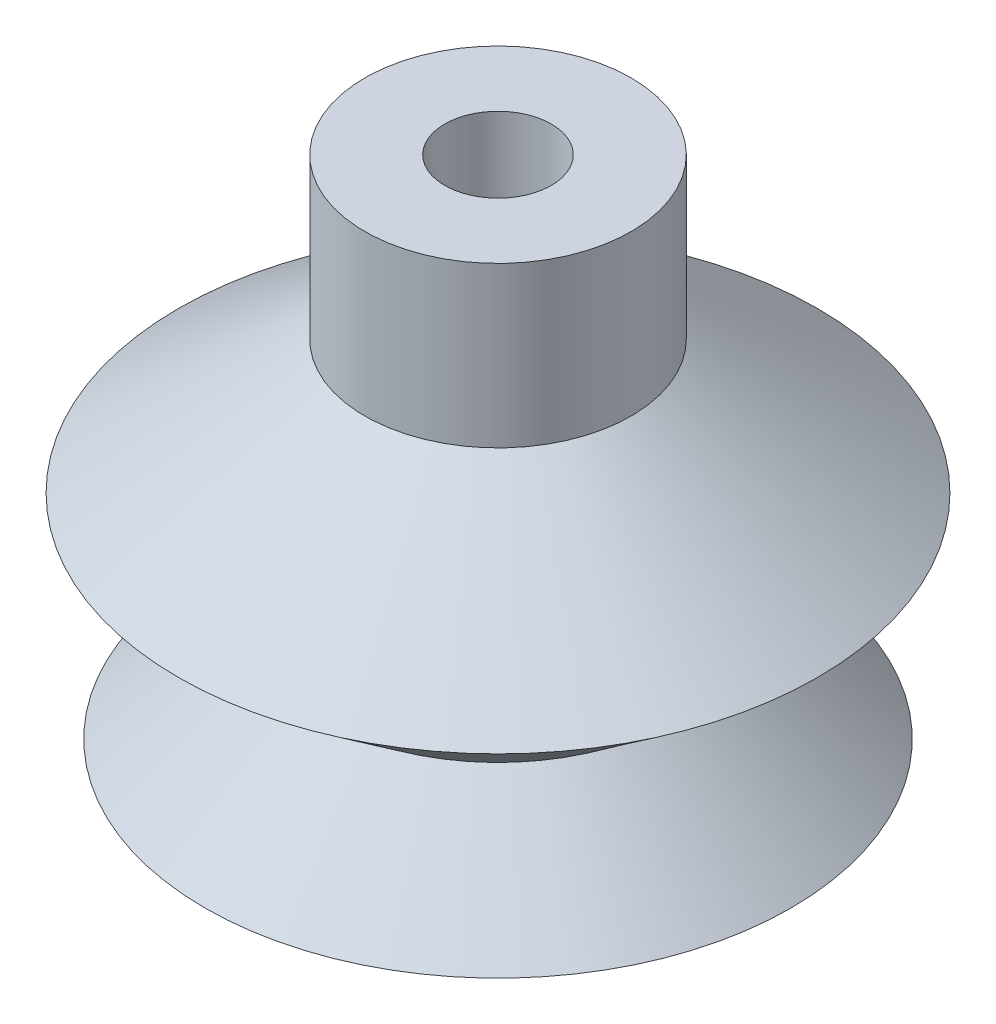
ISO-10303-21;
HEADER;
FILE_DESCRIPTION(('STEP AP214'),'2;1');
FILE_NAME('part.step','',(''),(''),'','','');
FILE_SCHEMA(('AUTOMOTIVE_DESIGN { 1 0 10303 214 1 1 1 1 }'));
ENDSEC;
DATA;
#1=APPLICATION_CONTEXT('core data for automotive mechanical design processes');
#2=APPLICATION_PROTOCOL_DEFINITION('international standard','automotive_design',2000,#1);
#3=PRODUCT_CONTEXT('',#1,'mechanical');
#4=PRODUCT('Part','Part','',(#3));
#5=PRODUCT_RELATED_PRODUCT_CATEGORY('part','',(#4));
#6=PRODUCT_DEFINITION_FORMATION('','',#4);
#7=PRODUCT_DEFINITION_CONTEXT('part definition',#1,'design');
#8=PRODUCT_DEFINITION('design','',#6,#7);
#9=PRODUCT_DEFINITION_SHAPE('','',#8);
#10=(LENGTH_UNIT() NAMED_UNIT(*) SI_UNIT(.MILLI.,.METRE.));
#11=(NAMED_UNIT(*) PLANE_ANGLE_UNIT() SI_UNIT($,.RADIAN.));
#12=(NAMED_UNIT(*) SI_UNIT($,.STERADIAN.) SOLID_ANGLE_UNIT());
#13=UNCERTAINTY_MEASURE_WITH_UNIT(LENGTH_MEASURE(1.E-05),#10,'distance_accuracy_value','');
#14=(GEOMETRIC_REPRESENTATION_CONTEXT(3) GLOBAL_UNCERTAINTY_ASSIGNED_CONTEXT((#13)) GLOBAL_UNIT_ASSIGNED_CONTEXT((#10,
#11,#12)) REPRESENTATION_CONTEXT('',''));
#15=CARTESIAN_POINT('',(0.,0.,0.));
#16=DIRECTION('',(0.,0.,1.));
#17=DIRECTION('',(1.,0.,0.));
#18=AXIS2_PLACEMENT_3D('',#15,#16,#17);
#19=CARTESIAN_POINT('',(5.,19.,0.));
#20=DIRECTION('',(0.,1.,0.));
#21=DIRECTION('',(0.,0.,1.));
#22=AXIS2_PLACEMENT_3D('',#19,#20,#21);
#23=PLANE('',#22);
#24=CARTESIAN_POINT('',(0.,19.,0.));
#25=DIRECTION('',(0.,-1.,0.));
#26=DIRECTION('',(0.,0.,-1.));
#27=AXIS2_PLACEMENT_3D('',#24,#25,#26);
#28=CIRCLE('',#27,2.);
#29=CARTESIAN_POINT('',(0.,19.,-2.));
#30=VERTEX_POINT('',#29);
#31=EDGE_CURVE('E66',#30,#30,#28,.T.);
#32=ORIENTED_EDGE('',*,*,#31,.T.);
#33=EDGE_LOOP('',(#32));
#34=FACE_BOUND('',#33,.T.);
#35=CARTESIAN_POINT('',(0.,19.,0.));
#36=DIRECTION('',(0.,-1.,0.));
#37=DIRECTION('',(0.,0.,-1.));
#38=AXIS2_PLACEMENT_3D('',#35,#36,#37);
#39=CIRCLE('',#38,5.);
#40=CARTESIAN_POINT('',(0.,19.,-5.));
#41=VERTEX_POINT('',#40);
#42=EDGE_CURVE('E10',#41,#41,#39,.T.);
#43=ORIENTED_EDGE('',*,*,#42,.F.);
#44=EDGE_LOOP('',(#43));
#45=FACE_BOUND('',#44,.T.);
#46=ADVANCED_FACE('F29',(#34,#45),#23,.T.);
#47=CARTESIAN_POINT('',(0.,0.,0.));
#48=DIRECTION('',(0.,-1.,0.));
#49=DIRECTION('',(0.,0.,-1.));
#50=AXIS2_PLACEMENT_3D('',#47,#48,#49);
#51=CYLINDRICAL_SURFACE('',#50,5.);
#52=ORIENTED_EDGE('',*,*,#42,.T.);
#53=EDGE_LOOP('',(#52));
#54=FACE_BOUND('',#53,.T.);
#55=CARTESIAN_POINT('',(0.,13.,0.));
#56=DIRECTION('',(0.,-1.,0.));
#57=DIRECTION('',(0.,0.,-1.));
#58=AXIS2_PLACEMENT_3D('',#55,#56,#57);
#59=CIRCLE('',#58,5.);
#60=CARTESIAN_POINT('',(0.,13.,-5.));
#61=VERTEX_POINT('',#60);
#62=EDGE_CURVE('E35',#61,#61,#59,.T.);
#63=ORIENTED_EDGE('',*,*,#62,.F.);
#64=EDGE_LOOP('',(#63));
#65=FACE_BOUND('',#64,.T.);
#66=ADVANCED_FACE('F84',(#54,#65),#51,.T.);
#67=CARTESIAN_POINT('',(0.,8.,0.));
#68=DIRECTION('',(0.,-1.,0.));
#69=DIRECTION('',(0.,0.,-1.));
#70=AXIS2_PLACEMENT_3D('',#67,#68,#69);
#71=CONICAL_SURFACE('',#70,12.,0.950546840812075);
#72=ORIENTED_EDGE('',*,*,#62,.T.);
#73=EDGE_LOOP('',(#72));
#74=FACE_BOUND('',#73,.T.);
#75=CARTESIAN_POINT('',(0.,8.,0.));
#76=DIRECTION('',(0.,-1.,0.));
#77=DIRECTION('',(0.,0.,-1.));
#78=AXIS2_PLACEMENT_3D('',#75,#76,#77);
#79=CIRCLE('',#78,12.);
#80=CARTESIAN_POINT('',(0.,8.,-12.));
#81=VERTEX_POINT('',#80);
#82=EDGE_CURVE('E39',#81,#81,#79,.T.);
#83=ORIENTED_EDGE('',*,*,#82,.F.);
#84=EDGE_LOOP('',(#83));
#85=FACE_BOUND('',#84,.T.);
#86=ADVANCED_FACE('F88',(#74,#85),#71,.T.);
#87=CARTESIAN_POINT('',(0.,4.,0.));
#88=DIRECTION('',(0.,1.,0.));
#89=DIRECTION('',(0.,0.,1.));
#90=AXIS2_PLACEMENT_3D('',#87,#88,#89);
#91=CONICAL_SURFACE('',#90,6.73864357705752,0.920760950293743);
#92=ORIENTED_EDGE('',*,*,#82,.T.);
#93=EDGE_LOOP('',(#92));
#94=FACE_BOUND('',#93,.T.);
#95=CARTESIAN_POINT('',(0.,4.,0.));
#96=DIRECTION('',(0.,-1.,0.));
#97=DIRECTION('',(0.,0.,-1.));
#98=AXIS2_PLACEMENT_3D('',#95,#96,#97);
#99=CIRCLE('',#98,6.73864357705752);
#100=CARTESIAN_POINT('',(0.,4.,-6.73864357705752));
#101=VERTEX_POINT('',#100);
#102=EDGE_CURVE('E43',#101,#101,#99,.T.);
#103=ORIENTED_EDGE('',*,*,#102,.F.);
#104=EDGE_LOOP('',(#103));
#105=FACE_BOUND('',#104,.T.);
#106=ADVANCED_FACE('F92',(#94,#105),#91,.T.);
#107=CARTESIAN_POINT('',(0.,0.,0.));
#108=DIRECTION('',(0.,-1.,0.));
#109=DIRECTION('',(0.,0.,-1.));
#110=AXIS2_PLACEMENT_3D('',#107,#108,#109);
#111=CONICAL_SURFACE('',#110,11.,0.817023633853532);
#112=ORIENTED_EDGE('',*,*,#102,.T.);
#113=EDGE_LOOP('',(#112));
#114=FACE_BOUND('',#113,.T.);
#115=CARTESIAN_POINT('',(0.,0.,0.));
#116=DIRECTION('',(0.,-1.,0.));
#117=DIRECTION('',(0.,0.,-1.));
#118=AXIS2_PLACEMENT_3D('',#115,#116,#117);
#119=CIRCLE('',#118,11.);
#120=CARTESIAN_POINT('',(0.,0.,-11.));
#121=VERTEX_POINT('',#120);
#122=EDGE_CURVE('E48',#121,#121,#119,.T.);
#123=ORIENTED_EDGE('',*,*,#122,.F.);
#124=EDGE_LOOP('',(#123));
#125=FACE_BOUND('',#124,.T.);
#126=ADVANCED_FACE('F98',(#114,#125),#111,.T.);
#127=CARTESIAN_POINT('',(11.,0.,0.));
#128=DIRECTION('',(0.,-1.,0.));
#129=DIRECTION('',(0.,0.,-1.));
#130=AXIS2_PLACEMENT_3D('',#127,#128,#129);
#131=PLANE('',#130);
#132=ORIENTED_EDGE('',*,*,#122,.T.);
#133=EDGE_LOOP('',(#132));
#134=FACE_BOUND('',#133,.T.);
#135=CARTESIAN_POINT('',(0.,0.,0.));
#136=DIRECTION('',(0.,-1.,0.));
#137=DIRECTION('',(0.,0.,-1.));
#138=AXIS2_PLACEMENT_3D('',#135,#136,#137);
#139=CIRCLE('',#138,9.53885407634639);
#140=CARTESIAN_POINT('',(0.,0.,-9.53885407634639));
#141=VERTEX_POINT('',#140);
#142=EDGE_CURVE('E51',#141,#141,#139,.T.);
#143=ORIENTED_EDGE('',*,*,#142,.F.);
#144=EDGE_LOOP('',(#143));
#145=FACE_BOUND('',#144,.T.);
#146=ADVANCED_FACE('F102',(#134,#145),#131,.T.);
#147=CARTESIAN_POINT('',(0.,4.,0.));
#148=DIRECTION('',(0.,-1.,0.));
#149=DIRECTION('',(0.,0.,-1.));
#150=AXIS2_PLACEMENT_3D('',#147,#148,#149);
#151=CONICAL_SURFACE('',#150,5.2774976534039,0.817023633853532);
#152=ORIENTED_EDGE('',*,*,#142,.T.);
#153=EDGE_LOOP('',(#152));
#154=FACE_BOUND('',#153,.T.);
#155=CARTESIAN_POINT('',(0.,4.,0.));
#156=DIRECTION('',(0.,-1.,0.));
#157=DIRECTION('',(0.,0.,-1.));
#158=AXIS2_PLACEMENT_3D('',#155,#156,#157);
#159=CIRCLE('',#158,5.2774976534039);
#160=CARTESIAN_POINT('',(0.,4.,-5.2774976534039));
#161=VERTEX_POINT('',#160);
#162=EDGE_CURVE('E54',#161,#161,#159,.T.);
#163=ORIENTED_EDGE('',*,*,#162,.F.);
#164=EDGE_LOOP('',(#163));
#165=FACE_BOUND('',#164,.T.);
#166=ADVANCED_FACE('F106',(#154,#165),#151,.F.);
#167=CARTESIAN_POINT('',(0.,8.,0.));
#168=DIRECTION('',(0.,1.,0.));
#169=DIRECTION('',(0.,0.,1.));
#170=AXIS2_PLACEMENT_3D('',#167,#168,#169);
#171=CONICAL_SURFACE('',#170,10.,0.868041502476456);
#172=ORIENTED_EDGE('',*,*,#162,.T.);
#173=EDGE_LOOP('',(#172));
#174=FACE_BOUND('',#173,.T.);
#175=CARTESIAN_POINT('',(0.,8.,0.));
#176=DIRECTION('',(0.,-1.,0.));
#177=DIRECTION('',(0.,0.,-1.));
#178=AXIS2_PLACEMENT_3D('',#175,#176,#177);
#179=CIRCLE('',#178,10.);
#180=CARTESIAN_POINT('',(0.,8.,-10.));
#181=VERTEX_POINT('',#180);
#182=EDGE_CURVE('E57',#181,#181,#179,.T.);
#183=ORIENTED_EDGE('',*,*,#182,.F.);
#184=EDGE_LOOP('',(#183));
#185=FACE_BOUND('',#184,.T.);
#186=ADVANCED_FACE('F110',(#174,#185),#171,.F.);
#187=CARTESIAN_POINT('',(0.,10.,0.));
#188=DIRECTION('',(0.,-1.,0.));
#189=DIRECTION('',(0.,0.,-1.));
#190=AXIS2_PLACEMENT_3D('',#187,#188,#189);
#191=CONICAL_SURFACE('',#190,3.68864893535733,1.26391762293674);
#192=ORIENTED_EDGE('',*,*,#182,.T.);
#193=EDGE_LOOP('',(#192));
#194=FACE_BOUND('',#193,.T.);
#195=CARTESIAN_POINT('',(0.,10.,0.));
#196=DIRECTION('',(0.,-1.,0.));
#197=DIRECTION('',(0.,0.,-1.));
#198=AXIS2_PLACEMENT_3D('',#195,#196,#197);
#199=CIRCLE('',#198,3.68864893535733);
#200=CARTESIAN_POINT('',(0.,10.,-3.68864893535733));
#201=VERTEX_POINT('',#200);
#202=EDGE_CURVE('E60',#201,#201,#199,.T.);
#203=ORIENTED_EDGE('',*,*,#202,.F.);
#204=EDGE_LOOP('',(#203));
#205=FACE_BOUND('',#204,.T.);
#206=ADVANCED_FACE('F80',(#194,#205),#191,.F.);
#207=CARTESIAN_POINT('',(2.,10.,0.));
#208=DIRECTION('',(0.,-1.,0.));
#209=DIRECTION('',(0.,0.,-1.));
#210=AXIS2_PLACEMENT_3D('',#207,#208,#209);
#211=PLANE('',#210);
#212=ORIENTED_EDGE('',*,*,#202,.T.);
#213=EDGE_LOOP('',(#212));
#214=FACE_BOUND('',#213,.T.);
#215=CARTESIAN_POINT('',(0.,10.,0.));
#216=DIRECTION('',(0.,-1.,0.));
#217=DIRECTION('',(0.,0.,-1.));
#218=AXIS2_PLACEMENT_3D('',#215,#216,#217);
#219=CIRCLE('',#218,2.);
#220=CARTESIAN_POINT('',(0.,10.,-2.));
#221=VERTEX_POINT('',#220);
#222=EDGE_CURVE('E63',#221,#221,#219,.T.);
#223=ORIENTED_EDGE('',*,*,#222,.F.);
#224=EDGE_LOOP('',(#223));
#225=FACE_BOUND('',#224,.T.);
#226=ADVANCED_FACE('F74',(#214,#225),#211,.T.);
#227=CARTESIAN_POINT('',(0.,0.,0.));
#228=DIRECTION('',(0.,-1.,0.));
#229=DIRECTION('',(0.,0.,-1.));
#230=AXIS2_PLACEMENT_3D('',#227,#228,#229);
#231=CYLINDRICAL_SURFACE('',#230,2.);
#232=ORIENTED_EDGE('',*,*,#222,.T.);
#233=EDGE_LOOP('',(#232));
#234=FACE_BOUND('',#233,.T.);
#235=ORIENTED_EDGE('',*,*,#31,.F.);
#236=EDGE_LOOP('',(#235));
#237=FACE_BOUND('',#236,.T.);
#238=ADVANCED_FACE('F72',(#234,#237),#231,.F.);
#239=CLOSED_SHELL('',(#46,#66,#86,#106,#126,#146,#166,#186,#206,#226,#238));
#240=MANIFOLD_SOLID_BREP('B2',#239);
#241=ADVANCED_BREP_SHAPE_REPRESENTATION('',(#18,#240),#14);
#242=SHAPE_DEFINITION_REPRESENTATION(#9,#241);
ENDSEC;
END-ISO-10303-21;
